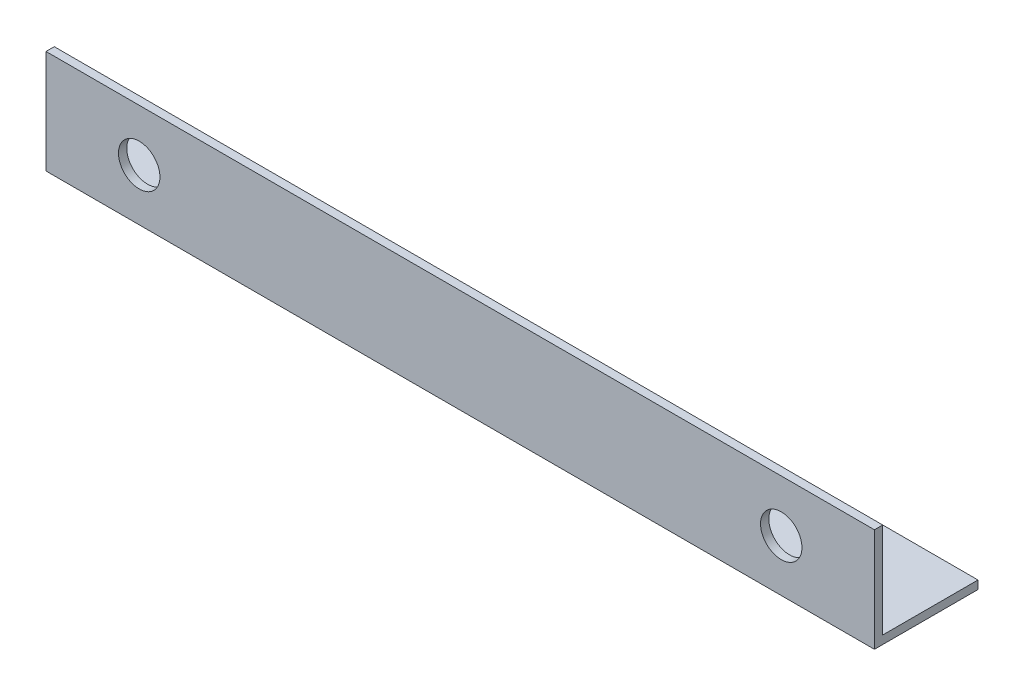
ISO-10303-21;
HEADER;
FILE_DESCRIPTION(('STEP AP214'),'2;1');
FILE_NAME('part.step','',(''),(''),'','','');
FILE_SCHEMA(('AUTOMOTIVE_DESIGN { 1 0 10303 214 1 1 1 1 }'));
ENDSEC;
DATA;
#1=APPLICATION_CONTEXT('core data for automotive mechanical design processes');
#2=APPLICATION_PROTOCOL_DEFINITION('international standard','automotive_design',2000,#1);
#3=PRODUCT_CONTEXT('',#1,'mechanical');
#4=PRODUCT('Part','Part','',(#3));
#5=PRODUCT_RELATED_PRODUCT_CATEGORY('part','',(#4));
#6=PRODUCT_DEFINITION_FORMATION('','',#4);
#7=PRODUCT_DEFINITION_CONTEXT('part definition',#1,'design');
#8=PRODUCT_DEFINITION('design','',#6,#7);
#9=PRODUCT_DEFINITION_SHAPE('','',#8);
#10=(LENGTH_UNIT() NAMED_UNIT(*) SI_UNIT(.MILLI.,.METRE.));
#11=(NAMED_UNIT(*) PLANE_ANGLE_UNIT() SI_UNIT($,.RADIAN.));
#12=(NAMED_UNIT(*) SI_UNIT($,.STERADIAN.) SOLID_ANGLE_UNIT());
#13=UNCERTAINTY_MEASURE_WITH_UNIT(LENGTH_MEASURE(1.E-05),#10,'distance_accuracy_value','');
#14=(GEOMETRIC_REPRESENTATION_CONTEXT(3) GLOBAL_UNCERTAINTY_ASSIGNED_CONTEXT((#13)) GLOBAL_UNIT_ASSIGNED_CONTEXT((#10,
#11,#12)) REPRESENTATION_CONTEXT('',''));
#15=CARTESIAN_POINT('',(0.,0.,0.));
#16=DIRECTION('',(0.,0.,1.));
#17=DIRECTION('',(1.,0.,0.));
#18=AXIS2_PLACEMENT_3D('',#15,#16,#17);
#19=CARTESIAN_POINT('',(200.,0.,0.));
#20=DIRECTION('',(0.,1.,0.));
#21=DIRECTION('',(0.,0.,1.));
#22=AXIS2_PLACEMENT_3D('',#19,#20,#21);
#23=PLANE('',#22);
#24=DIRECTION('',(0.,0.,-1.));
#25=VECTOR('',#24,1.);
#26=CARTESIAN_POINT('',(0.,0.,0.));
#27=LINE('',#26,#25);
#28=CARTESIAN_POINT('',(0.,0.,0.));
#29=VERTEX_POINT('',#28);
#30=CARTESIAN_POINT('',(0.,0.,-25.));
#31=VERTEX_POINT('',#30);
#32=EDGE_CURVE('E117',#29,#31,#27,.T.);
#33=ORIENTED_EDGE('',*,*,#32,.T.);
#34=DIRECTION('',(-1.,0.,0.));
#35=VECTOR('',#34,1.);
#36=CARTESIAN_POINT('',(200.,0.,-25.));
#37=LINE('',#36,#35);
#38=CARTESIAN_POINT('',(200.,0.,-25.));
#39=VERTEX_POINT('',#38);
#40=EDGE_CURVE('E11',#39,#31,#37,.T.);
#41=ORIENTED_EDGE('',*,*,#40,.F.);
#42=DIRECTION('',(0.,0.,-1.));
#43=VECTOR('',#42,1.);
#44=CARTESIAN_POINT('',(200.,0.,0.));
#45=LINE('',#44,#43);
#46=CARTESIAN_POINT('',(200.,0.,0.));
#47=VERTEX_POINT('',#46);
#48=EDGE_CURVE('E82',#47,#39,#45,.T.);
#49=ORIENTED_EDGE('',*,*,#48,.F.);
#50=DIRECTION('',(-1.,0.,0.));
#51=VECTOR('',#50,1.);
#52=CARTESIAN_POINT('',(200.,0.,0.));
#53=LINE('',#52,#51);
#54=EDGE_CURVE('E113',#47,#29,#53,.T.);
#55=ORIENTED_EDGE('',*,*,#54,.T.);
#56=EDGE_LOOP('',(#33,#41,#49,#55));
#57=FACE_BOUND('',#56,.T.);
#58=ADVANCED_FACE('F36',(#57),#23,.F.);
#59=CARTESIAN_POINT('',(200.,2.,-25.));
#60=DIRECTION('',(0.,0.,-1.));
#61=DIRECTION('',(-1.,0.,0.));
#62=AXIS2_PLACEMENT_3D('',#59,#60,#61);
#63=PLANE('',#62);
#64=DIRECTION('',(0.,-1.,0.));
#65=VECTOR('',#64,1.);
#66=CARTESIAN_POINT('',(0.,2.,-25.));
#67=LINE('',#66,#65);
#68=CARTESIAN_POINT('',(0.,2.,-25.));
#69=VERTEX_POINT('',#68);
#70=EDGE_CURVE('E120',#69,#31,#67,.T.);
#71=ORIENTED_EDGE('',*,*,#70,.F.);
#72=DIRECTION('',(-1.,0.,0.));
#73=VECTOR('',#72,1.);
#74=CARTESIAN_POINT('',(200.,2.,-25.));
#75=LINE('',#74,#73);
#76=CARTESIAN_POINT('',(200.,2.,-25.));
#77=VERTEX_POINT('',#76);
#78=EDGE_CURVE('E44',#77,#69,#75,.T.);
#79=ORIENTED_EDGE('',*,*,#78,.F.);
#80=DIRECTION('',(0.,-1.,0.));
#81=VECTOR('',#80,1.);
#82=CARTESIAN_POINT('',(200.,2.,-25.));
#83=LINE('',#82,#81);
#84=EDGE_CURVE('E184',#77,#39,#83,.T.);
#85=ORIENTED_EDGE('',*,*,#84,.T.);
#86=ORIENTED_EDGE('',*,*,#40,.T.);
#87=EDGE_LOOP('',(#71,#79,#85,#86));
#88=FACE_BOUND('',#87,.T.);
#89=ADVANCED_FACE('F139',(#88),#63,.T.);
#90=CARTESIAN_POINT('',(200.,2.,0.));
#91=DIRECTION('',(0.,1.,0.));
#92=DIRECTION('',(0.,0.,1.));
#93=AXIS2_PLACEMENT_3D('',#90,#91,#92);
#94=PLANE('',#93);
#95=DIRECTION('',(0.,0.,-1.));
#96=VECTOR('',#95,1.);
#97=CARTESIAN_POINT('',(0.,2.,0.));
#98=LINE('',#97,#96);
#99=CARTESIAN_POINT('',(0.,2.,-2.));
#100=VERTEX_POINT('',#99);
#101=EDGE_CURVE('E124',#100,#69,#98,.T.);
#102=ORIENTED_EDGE('',*,*,#101,.F.);
#103=DIRECTION('',(-1.,0.,0.));
#104=VECTOR('',#103,1.);
#105=CARTESIAN_POINT('',(200.,2.,-2.));
#106=LINE('',#105,#104);
#107=CARTESIAN_POINT('',(200.,2.,-2.));
#108=VERTEX_POINT('',#107);
#109=EDGE_CURVE('E103',#108,#100,#106,.T.);
#110=ORIENTED_EDGE('',*,*,#109,.F.);
#111=DIRECTION('',(0.,0.,-1.));
#112=VECTOR('',#111,1.);
#113=CARTESIAN_POINT('',(200.,2.,0.));
#114=LINE('',#113,#112);
#115=EDGE_CURVE('E109',#108,#77,#114,.T.);
#116=ORIENTED_EDGE('',*,*,#115,.T.);
#117=ORIENTED_EDGE('',*,*,#78,.T.);
#118=EDGE_LOOP('',(#102,#110,#116,#117));
#119=FACE_BOUND('',#118,.T.);
#120=ADVANCED_FACE('F136',(#119),#94,.T.);
#121=CARTESIAN_POINT('',(200.,25.,-2.));
#122=DIRECTION('',(0.,0.,-1.));
#123=DIRECTION('',(0.,1.,0.));
#124=AXIS2_PLACEMENT_3D('',#121,#122,#123);
#125=PLANE('',#124);
#126=CARTESIAN_POINT('',(177.5,12.5,-2.));
#127=DIRECTION('',(0.,0.,-1.));
#128=DIRECTION('',(0.,1.,0.));
#129=AXIS2_PLACEMENT_3D('',#126,#127,#128);
#130=CIRCLE('',#129,4.99999999999999);
#131=CARTESIAN_POINT('',(177.5,17.5,-2.));
#132=VERTEX_POINT('',#131);
#133=EDGE_CURVE('E173',#132,#132,#130,.T.);
#134=ORIENTED_EDGE('',*,*,#133,.F.);
#135=EDGE_LOOP('',(#134));
#136=FACE_BOUND('',#135,.T.);
#137=CARTESIAN_POINT('',(22.5,12.5,-2.));
#138=DIRECTION('',(0.,0.,-1.));
#139=DIRECTION('',(0.,1.,0.));
#140=AXIS2_PLACEMENT_3D('',#137,#138,#139);
#141=CIRCLE('',#140,4.99999999999999);
#142=CARTESIAN_POINT('',(22.5,17.5,-2.));
#143=VERTEX_POINT('',#142);
#144=EDGE_CURVE('E121',#143,#143,#141,.T.);
#145=ORIENTED_EDGE('',*,*,#144,.F.);
#146=EDGE_LOOP('',(#145));
#147=FACE_BOUND('',#146,.T.);
#148=DIRECTION('',(0.,-1.,0.));
#149=VECTOR('',#148,1.);
#150=CARTESIAN_POINT('',(0.,25.,-2.));
#151=LINE('',#150,#149);
#152=CARTESIAN_POINT('',(0.,25.,-2.));
#153=VERTEX_POINT('',#152);
#154=EDGE_CURVE('E98',#153,#100,#151,.T.);
#155=ORIENTED_EDGE('',*,*,#154,.F.);
#156=DIRECTION('',(-1.,0.,0.));
#157=VECTOR('',#156,1.);
#158=CARTESIAN_POINT('',(200.,25.,-2.));
#159=LINE('',#158,#157);
#160=CARTESIAN_POINT('',(200.,25.,-2.));
#161=VERTEX_POINT('',#160);
#162=EDGE_CURVE('E93',#161,#153,#159,.T.);
#163=ORIENTED_EDGE('',*,*,#162,.F.);
#164=DIRECTION('',(0.,-1.,0.));
#165=VECTOR('',#164,1.);
#166=CARTESIAN_POINT('',(200.,25.,-2.));
#167=LINE('',#166,#165);
#168=EDGE_CURVE('E96',#161,#108,#167,.T.);
#169=ORIENTED_EDGE('',*,*,#168,.T.);
#170=ORIENTED_EDGE('',*,*,#109,.T.);
#171=EDGE_LOOP('',(#155,#163,#169,#170));
#172=FACE_BOUND('',#171,.T.);
#173=ADVANCED_FACE('F95',(#136,#147,#172),#125,.T.);
#174=CARTESIAN_POINT('',(200.,25.,0.));
#175=DIRECTION('',(0.,1.,0.));
#176=DIRECTION('',(0.,0.,1.));
#177=AXIS2_PLACEMENT_3D('',#174,#175,#176);
#178=PLANE('',#177);
#179=DIRECTION('',(0.,0.,-1.));
#180=VECTOR('',#179,1.);
#181=CARTESIAN_POINT('',(0.,25.,0.));
#182=LINE('',#181,#180);
#183=CARTESIAN_POINT('',(0.,25.,0.));
#184=VERTEX_POINT('',#183);
#185=EDGE_CURVE('E128',#184,#153,#182,.T.);
#186=ORIENTED_EDGE('',*,*,#185,.F.);
#187=DIRECTION('',(-1.,0.,0.));
#188=VECTOR('',#187,1.);
#189=CARTESIAN_POINT('',(200.,25.,0.));
#190=LINE('',#189,#188);
#191=CARTESIAN_POINT('',(200.,25.,0.));
#192=VERTEX_POINT('',#191);
#193=EDGE_CURVE('E73',#192,#184,#190,.T.);
#194=ORIENTED_EDGE('',*,*,#193,.F.);
#195=DIRECTION('',(0.,0.,-1.));
#196=VECTOR('',#195,1.);
#197=CARTESIAN_POINT('',(200.,25.,0.));
#198=LINE('',#197,#196);
#199=EDGE_CURVE('E107',#192,#161,#198,.T.);
#200=ORIENTED_EDGE('',*,*,#199,.T.);
#201=ORIENTED_EDGE('',*,*,#162,.T.);
#202=EDGE_LOOP('',(#186,#194,#200,#201));
#203=FACE_BOUND('',#202,.T.);
#204=ADVANCED_FACE('F111',(#203),#178,.T.);
#205=CARTESIAN_POINT('',(200.,25.,0.));
#206=DIRECTION('',(0.,0.,-1.));
#207=DIRECTION('',(0.,1.,0.));
#208=AXIS2_PLACEMENT_3D('',#205,#206,#207);
#209=PLANE('',#208);
#210=CARTESIAN_POINT('',(177.5,12.5,0.));
#211=DIRECTION('',(0.,0.,1.));
#212=DIRECTION('',(-1.,0.,0.));
#213=AXIS2_PLACEMENT_3D('',#210,#211,#212);
#214=CIRCLE('',#213,4.99999999999999);
#215=CARTESIAN_POINT('',(172.5,12.5,0.));
#216=VERTEX_POINT('',#215);
#217=EDGE_CURVE('E186',#216,#216,#214,.T.);
#218=ORIENTED_EDGE('',*,*,#217,.F.);
#219=EDGE_LOOP('',(#218));
#220=FACE_BOUND('',#219,.T.);
#221=CARTESIAN_POINT('',(22.5,12.5,0.));
#222=DIRECTION('',(0.,0.,1.));
#223=DIRECTION('',(1.,0.,0.));
#224=AXIS2_PLACEMENT_3D('',#221,#222,#223);
#225=CIRCLE('',#224,4.99999999999999);
#226=CARTESIAN_POINT('',(27.5,12.5,0.));
#227=VERTEX_POINT('',#226);
#228=EDGE_CURVE('E177',#227,#227,#225,.T.);
#229=ORIENTED_EDGE('',*,*,#228,.F.);
#230=EDGE_LOOP('',(#229));
#231=FACE_BOUND('',#230,.T.);
#232=DIRECTION('',(0.,-1.,0.));
#233=VECTOR('',#232,1.);
#234=CARTESIAN_POINT('',(0.,25.,0.));
#235=LINE('',#234,#233);
#236=EDGE_CURVE('E76',#184,#29,#235,.T.);
#237=ORIENTED_EDGE('',*,*,#236,.T.);
#238=ORIENTED_EDGE('',*,*,#54,.F.);
#239=DIRECTION('',(0.,-1.,0.));
#240=VECTOR('',#239,1.);
#241=CARTESIAN_POINT('',(200.,25.,0.));
#242=LINE('',#241,#240);
#243=EDGE_CURVE('E52',#192,#47,#242,.T.);
#244=ORIENTED_EDGE('',*,*,#243,.F.);
#245=ORIENTED_EDGE('',*,*,#193,.T.);
#246=EDGE_LOOP('',(#237,#238,#244,#245));
#247=FACE_BOUND('',#246,.T.);
#248=ADVANCED_FACE('F144',(#220,#231,#247),#209,.F.);
#249=CARTESIAN_POINT('',(200.,0.,0.));
#250=DIRECTION('',(-1.,0.,0.));
#251=DIRECTION('',(0.,0.,1.));
#252=AXIS2_PLACEMENT_3D('',#249,#250,#251);
#253=PLANE('',#252);
#254=ORIENTED_EDGE('',*,*,#48,.T.);
#255=ORIENTED_EDGE('',*,*,#84,.F.);
#256=ORIENTED_EDGE('',*,*,#115,.F.);
#257=ORIENTED_EDGE('',*,*,#168,.F.);
#258=ORIENTED_EDGE('',*,*,#199,.F.);
#259=ORIENTED_EDGE('',*,*,#243,.T.);
#260=EDGE_LOOP('',(#254,#255,#256,#257,#258,#259));
#261=FACE_BOUND('',#260,.T.);
#262=ADVANCED_FACE('F106',(#261),#253,.F.);
#263=CARTESIAN_POINT('',(0.,0.,0.));
#264=DIRECTION('',(-1.,0.,0.));
#265=DIRECTION('',(0.,0.,1.));
#266=AXIS2_PLACEMENT_3D('',#263,#264,#265);
#267=PLANE('',#266);
#268=ORIENTED_EDGE('',*,*,#32,.F.);
#269=ORIENTED_EDGE('',*,*,#236,.F.);
#270=ORIENTED_EDGE('',*,*,#185,.T.);
#271=ORIENTED_EDGE('',*,*,#154,.T.);
#272=ORIENTED_EDGE('',*,*,#101,.T.);
#273=ORIENTED_EDGE('',*,*,#70,.T.);
#274=EDGE_LOOP('',(#268,#269,#270,#271,#272,#273));
#275=FACE_BOUND('',#274,.T.);
#276=ADVANCED_FACE('F142',(#275),#267,.T.);
#277=CARTESIAN_POINT('',(22.5,12.5,-25.));
#278=DIRECTION('',(0.,0.,1.));
#279=DIRECTION('',(1.,0.,0.));
#280=AXIS2_PLACEMENT_3D('',#277,#278,#279);
#281=CYLINDRICAL_SURFACE('',#280,4.99999999999999);
#282=ORIENTED_EDGE('',*,*,#144,.T.);
#283=EDGE_LOOP('',(#282));
#284=FACE_BOUND('',#283,.T.);
#285=ORIENTED_EDGE('',*,*,#228,.T.);
#286=EDGE_LOOP('',(#285));
#287=FACE_BOUND('',#286,.T.);
#288=ADVANCED_FACE('F191',(#284,#287),#281,.F.);
#289=CARTESIAN_POINT('',(177.5,12.5,-25.));
#290=DIRECTION('',(0.,0.,1.));
#291=DIRECTION('',(1.,0.,0.));
#292=AXIS2_PLACEMENT_3D('',#289,#290,#291);
#293=CYLINDRICAL_SURFACE('',#292,4.99999999999999);
#294=ORIENTED_EDGE('',*,*,#133,.T.);
#295=EDGE_LOOP('',(#294));
#296=FACE_BOUND('',#295,.T.);
#297=ORIENTED_EDGE('',*,*,#217,.T.);
#298=EDGE_LOOP('',(#297));
#299=FACE_BOUND('',#298,.T.);
#300=ADVANCED_FACE('F189',(#296,#299),#293,.F.);
#301=CLOSED_SHELL('',(#58,#89,#120,#173,#204,#248,#262,#276,#288,#300));
#302=MANIFOLD_SOLID_BREP('B2',#301);
#303=ADVANCED_BREP_SHAPE_REPRESENTATION('',(#18,#302),#14);
#304=SHAPE_DEFINITION_REPRESENTATION(#9,#303);
ENDSEC;
END-ISO-10303-21;
